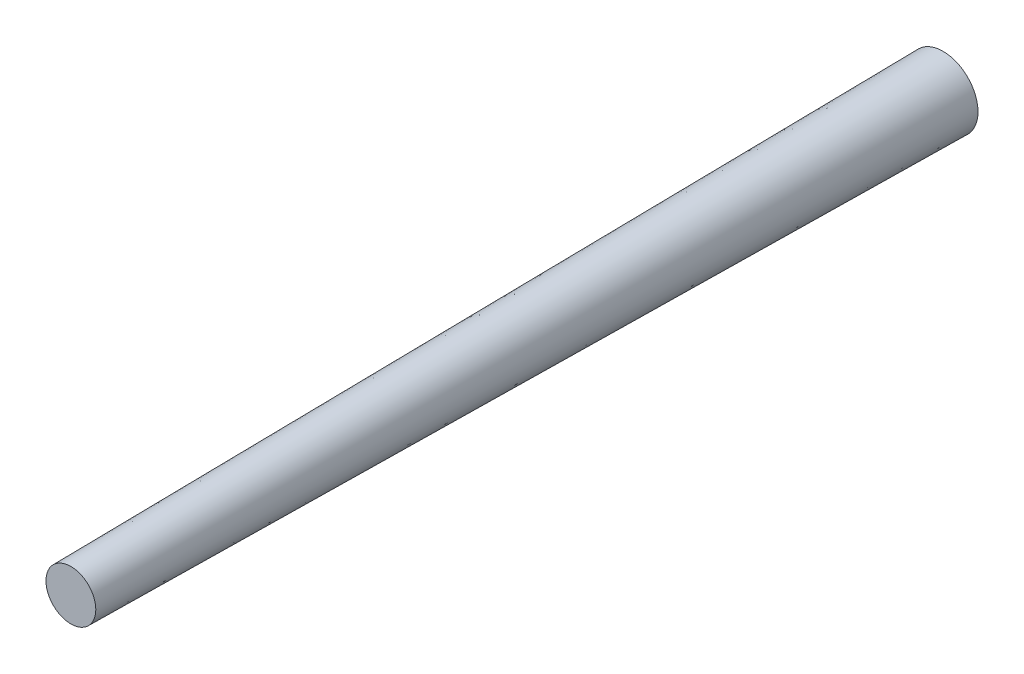
ISO-10303-21;
HEADER;
FILE_DESCRIPTION(('STEP AP214'),'2;1');
FILE_NAME('part.step','',(''),(''),'','','');
FILE_SCHEMA(('AUTOMOTIVE_DESIGN { 1 0 10303 214 1 1 1 1 }'));
ENDSEC;
DATA;
#1=APPLICATION_CONTEXT('core data for automotive mechanical design processes');
#2=APPLICATION_PROTOCOL_DEFINITION('international standard','automotive_design',2000,#1);
#3=PRODUCT_CONTEXT('',#1,'mechanical');
#4=PRODUCT('Part','Part','',(#3));
#5=PRODUCT_RELATED_PRODUCT_CATEGORY('part','',(#4));
#6=PRODUCT_DEFINITION_FORMATION('','',#4);
#7=PRODUCT_DEFINITION_CONTEXT('part definition',#1,'design');
#8=PRODUCT_DEFINITION('design','',#6,#7);
#9=PRODUCT_DEFINITION_SHAPE('','',#8);
#10=(LENGTH_UNIT() NAMED_UNIT(*) SI_UNIT(.MILLI.,.METRE.));
#11=(NAMED_UNIT(*) PLANE_ANGLE_UNIT() SI_UNIT($,.RADIAN.));
#12=(NAMED_UNIT(*) SI_UNIT($,.STERADIAN.) SOLID_ANGLE_UNIT());
#13=UNCERTAINTY_MEASURE_WITH_UNIT(LENGTH_MEASURE(1.E-05),#10,'distance_accuracy_value','');
#14=(GEOMETRIC_REPRESENTATION_CONTEXT(3) GLOBAL_UNCERTAINTY_ASSIGNED_CONTEXT((#13)) GLOBAL_UNIT_ASSIGNED_CONTEXT((#10,
#11,#12)) REPRESENTATION_CONTEXT('',''));
#15=CARTESIAN_POINT('',(0.,0.,0.));
#16=DIRECTION('',(0.,0.,1.));
#17=DIRECTION('',(1.,0.,0.));
#18=AXIS2_PLACEMENT_3D('',#15,#16,#17);
#19=CARTESIAN_POINT('',(0.,0.,0.));
#20=DIRECTION('',(0.,0.,1.));
#21=DIRECTION('',(1.,0.,0.));
#22=AXIS2_PLACEMENT_3D('',#19,#20,#21);
#23=PLANE('',#22);
#24=CARTESIAN_POINT('',(0.,0.,0.));
#25=DIRECTION('',(0.,0.,1.));
#26=DIRECTION('',(1.,0.,0.));
#27=AXIS2_PLACEMENT_3D('',#24,#25,#26);
#28=CIRCLE('',#27,3.556);
#29=CARTESIAN_POINT('',(3.556,0.,0.));
#30=VERTEX_POINT('',#29);
#31=EDGE_CURVE('E11',#30,#30,#28,.T.);
#32=ORIENTED_EDGE('',*,*,#31,.F.);
#33=EDGE_LOOP('',(#32));
#34=FACE_BOUND('',#33,.T.);
#35=ADVANCED_FACE('F35',(#34),#23,.F.);
#36=CARTESIAN_POINT('',(0.,0.,88.9));
#37=DIRECTION('',(0.,0.,1.));
#38=DIRECTION('',(1.,0.,0.));
#39=AXIS2_PLACEMENT_3D('',#36,#37,#38);
#40=PLANE('',#39);
#41=CARTESIAN_POINT('',(0.,0.,88.9));
#42=DIRECTION('',(0.,0.,1.));
#43=DIRECTION('',(1.,0.,0.));
#44=AXIS2_PLACEMENT_3D('',#41,#42,#43);
#45=CIRCLE('',#44,2.54);
#46=CARTESIAN_POINT('',(2.54,0.,88.9));
#47=VERTEX_POINT('',#46);
#48=EDGE_CURVE('E43',#47,#47,#45,.T.);
#49=ORIENTED_EDGE('',*,*,#48,.T.);
#50=EDGE_LOOP('',(#49));
#51=FACE_BOUND('',#50,.T.);
#52=ADVANCED_FACE('F67',(#51),#40,.T.);
#53=CARTESIAN_POINT('',(0.,0.,88.9));
#54=DIRECTION('',(0.,0.,-1.));
#55=DIRECTION('',(-1.,0.,0.));
#56=AXIS2_PLACEMENT_3D('',#53,#54,#55);
#57=CONICAL_SURFACE('',#56,2.54,0.0114280738971043);
#58=ORIENTED_EDGE('',*,*,#48,.F.);
#59=EDGE_LOOP('',(#58));
#60=FACE_BOUND('',#59,.T.);
#61=ORIENTED_EDGE('',*,*,#31,.T.);
#62=EDGE_LOOP('',(#61));
#63=FACE_BOUND('',#62,.T.);
#64=ADVANCED_FACE('F75',(#60,#63),#57,.T.);
#65=CLOSED_SHELL('',(#35,#52,#64));
#66=MANIFOLD_SOLID_BREP('B2',#65);
#67=ADVANCED_BREP_SHAPE_REPRESENTATION('',(#18,#66),#14);
#68=SHAPE_DEFINITION_REPRESENTATION(#9,#67);
ENDSEC;
END-ISO-10303-21;
